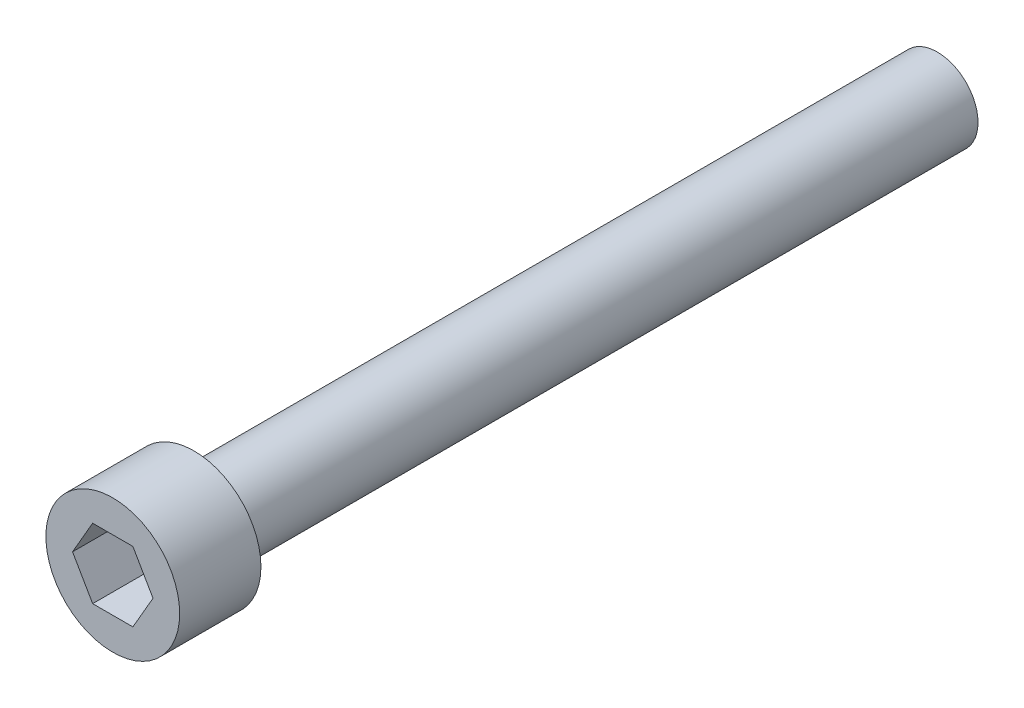
ISO-10303-21;
HEADER;
FILE_DESCRIPTION(('STEP AP214'),'2;1');
FILE_NAME('part.step','',(''),(''),'','','');
FILE_SCHEMA(('AUTOMOTIVE_DESIGN { 1 0 10303 214 1 1 1 1 }'));
ENDSEC;
DATA;
#1=APPLICATION_CONTEXT('core data for automotive mechanical design processes');
#2=APPLICATION_PROTOCOL_DEFINITION('international standard','automotive_design',2000,#1);
#3=PRODUCT_CONTEXT('',#1,'mechanical');
#4=PRODUCT('Part','Part','',(#3));
#5=PRODUCT_RELATED_PRODUCT_CATEGORY('part','',(#4));
#6=PRODUCT_DEFINITION_FORMATION('','',#4);
#7=PRODUCT_DEFINITION_CONTEXT('part definition',#1,'design');
#8=PRODUCT_DEFINITION('design','',#6,#7);
#9=PRODUCT_DEFINITION_SHAPE('','',#8);
#10=(LENGTH_UNIT() NAMED_UNIT(*) SI_UNIT(.MILLI.,.METRE.));
#11=(NAMED_UNIT(*) PLANE_ANGLE_UNIT() SI_UNIT($,.RADIAN.));
#12=(NAMED_UNIT(*) SI_UNIT($,.STERADIAN.) SOLID_ANGLE_UNIT());
#13=UNCERTAINTY_MEASURE_WITH_UNIT(LENGTH_MEASURE(1.E-05),#10,'distance_accuracy_value','');
#14=(GEOMETRIC_REPRESENTATION_CONTEXT(3) GLOBAL_UNCERTAINTY_ASSIGNED_CONTEXT((#13)) GLOBAL_UNIT_ASSIGNED_CONTEXT((#10,
#11,#12)) REPRESENTATION_CONTEXT('',''));
#15=CARTESIAN_POINT('',(0.,0.,0.));
#16=DIRECTION('',(0.,0.,1.));
#17=DIRECTION('',(1.,0.,0.));
#18=AXIS2_PLACEMENT_3D('',#15,#16,#17);
#19=CARTESIAN_POINT('',(3.42900000000001,0.,0.));
#20=DIRECTION('',(0.,0.,1.));
#21=DIRECTION('',(1.,0.,0.));
#22=AXIS2_PLACEMENT_3D('',#19,#20,#21);
#23=PLANE('',#22);
#24=DIRECTION('',(0.5,0.866025403784439,0.));
#25=VECTOR('',#24,1.);
#26=CARTESIAN_POINT('',(1.03111149638085,-1.7859375,0.));
#27=LINE('',#26,#25);
#28=CARTESIAN_POINT('',(1.03111149638085,-1.7859375,0.));
#29=VERTEX_POINT('',#28);
#30=CARTESIAN_POINT('',(2.06222299276169,0.,0.));
#31=VERTEX_POINT('',#30);
#32=EDGE_CURVE('E47',#29,#31,#27,.T.);
#33=ORIENTED_EDGE('',*,*,#32,.F.);
#34=DIRECTION('',(1.,0.,0.));
#35=VECTOR('',#34,1.);
#36=CARTESIAN_POINT('',(-1.03111149638085,-1.7859375,0.));
#37=LINE('',#36,#35);
#38=CARTESIAN_POINT('',(-1.03111149638085,-1.7859375,0.));
#39=VERTEX_POINT('',#38);
#40=EDGE_CURVE('E130',#39,#29,#37,.T.);
#41=ORIENTED_EDGE('',*,*,#40,.F.);
#42=DIRECTION('',(0.5,-0.866025403784439,0.));
#43=VECTOR('',#42,1.);
#44=CARTESIAN_POINT('',(-2.06222299276169,0.,0.));
#45=LINE('',#44,#43);
#46=CARTESIAN_POINT('',(-2.06222299276169,0.,0.));
#47=VERTEX_POINT('',#46);
#48=EDGE_CURVE('E128',#47,#39,#45,.T.);
#49=ORIENTED_EDGE('',*,*,#48,.F.);
#50=DIRECTION('',(-0.5,-0.866025403784439,0.));
#51=VECTOR('',#50,1.);
#52=CARTESIAN_POINT('',(-1.03111149638085,1.7859375,0.));
#53=LINE('',#52,#51);
#54=CARTESIAN_POINT('',(-1.03111149638085,1.7859375,0.));
#55=VERTEX_POINT('',#54);
#56=EDGE_CURVE('E95',#55,#47,#53,.T.);
#57=ORIENTED_EDGE('',*,*,#56,.F.);
#58=DIRECTION('',(-1.,0.,0.));
#59=VECTOR('',#58,1.);
#60=CARTESIAN_POINT('',(1.03111149638085,1.7859375,0.));
#61=LINE('',#60,#59);
#62=CARTESIAN_POINT('',(1.03111149638085,1.7859375,0.));
#63=VERTEX_POINT('',#62);
#64=EDGE_CURVE('E124',#63,#55,#61,.T.);
#65=ORIENTED_EDGE('',*,*,#64,.F.);
#66=DIRECTION('',(-0.5,0.866025403784438,0.));
#67=VECTOR('',#66,1.);
#68=CARTESIAN_POINT('',(2.06222299276169,0.,0.));
#69=LINE('',#68,#67);
#70=EDGE_CURVE('E121',#31,#63,#69,.T.);
#71=ORIENTED_EDGE('',*,*,#70,.F.);
#72=EDGE_LOOP('',(#33,#41,#49,#57,#65,#71));
#73=FACE_BOUND('',#72,.T.);
#74=CARTESIAN_POINT('',(0.,0.,0.));
#75=DIRECTION('',(0.,0.,1.));
#76=DIRECTION('',(1.,0.,0.));
#77=AXIS2_PLACEMENT_3D('',#74,#75,#76);
#78=CIRCLE('',#77,3.42900000000001);
#79=CARTESIAN_POINT('',(3.42900000000001,0.,0.));
#80=VERTEX_POINT('',#79);
#81=EDGE_CURVE('E134',#80,#80,#78,.T.);
#82=ORIENTED_EDGE('',*,*,#81,.T.);
#83=EDGE_LOOP('',(#82));
#84=FACE_BOUND('',#83,.T.);
#85=ADVANCED_FACE('F33',(#73,#84),#23,.T.);
#86=CARTESIAN_POINT('',(0.,0.,-42.2656));
#87=DIRECTION('',(0.,0.,-1.));
#88=DIRECTION('',(-1.,0.,0.));
#89=AXIS2_PLACEMENT_3D('',#86,#87,#88);
#90=PLANE('',#89);
#91=CARTESIAN_POINT('',(0.,0.,-42.2656));
#92=DIRECTION('',(0.,0.,1.));
#93=DIRECTION('',(1.,0.,0.));
#94=AXIS2_PLACEMENT_3D('',#91,#92,#93);
#95=CIRCLE('',#94,2.0828);
#96=CARTESIAN_POINT('',(2.08280000000001,0.,-42.2656));
#97=VERTEX_POINT('',#96);
#98=EDGE_CURVE('E11',#97,#97,#95,.T.);
#99=ORIENTED_EDGE('',*,*,#98,.F.);
#100=EDGE_LOOP('',(#99));
#101=FACE_BOUND('',#100,.T.);
#102=ADVANCED_FACE('F152',(#101),#90,.T.);
#103=CARTESIAN_POINT('',(0.,0.,0.));
#104=DIRECTION('',(0.,0.,1.));
#105=DIRECTION('',(1.,0.,0.));
#106=AXIS2_PLACEMENT_3D('',#103,#104,#105);
#107=CYLINDRICAL_SURFACE('',#106,2.08280000000001);
#108=ORIENTED_EDGE('',*,*,#98,.T.);
#109=EDGE_LOOP('',(#108));
#110=FACE_BOUND('',#109,.T.);
#111=CARTESIAN_POINT('',(0.,0.,-4.1656));
#112=DIRECTION('',(0.,0.,1.));
#113=DIRECTION('',(1.,0.,0.));
#114=AXIS2_PLACEMENT_3D('',#111,#112,#113);
#115=CIRCLE('',#114,2.08280000000001);
#116=CARTESIAN_POINT('',(2.08280000000001,0.,-4.1656));
#117=VERTEX_POINT('',#116);
#118=EDGE_CURVE('E40',#117,#117,#115,.T.);
#119=ORIENTED_EDGE('',*,*,#118,.F.);
#120=EDGE_LOOP('',(#119));
#121=FACE_BOUND('',#120,.T.);
#122=ADVANCED_FACE('F150',(#110,#121),#107,.T.);
#123=CARTESIAN_POINT('',(2.08280000000001,0.,-4.1656));
#124=DIRECTION('',(0.,0.,-1.));
#125=DIRECTION('',(-1.,0.,0.));
#126=AXIS2_PLACEMENT_3D('',#123,#124,#125);
#127=PLANE('',#126);
#128=ORIENTED_EDGE('',*,*,#118,.T.);
#129=EDGE_LOOP('',(#128));
#130=FACE_BOUND('',#129,.T.);
#131=CARTESIAN_POINT('',(0.,0.,-4.1656));
#132=DIRECTION('',(0.,0.,1.));
#133=DIRECTION('',(1.,0.,0.));
#134=AXIS2_PLACEMENT_3D('',#131,#132,#133);
#135=CIRCLE('',#134,3.429);
#136=CARTESIAN_POINT('',(3.429,0.,-4.1656));
#137=VERTEX_POINT('',#136);
#138=EDGE_CURVE('E142',#137,#137,#135,.T.);
#139=ORIENTED_EDGE('',*,*,#138,.F.);
#140=EDGE_LOOP('',(#139));
#141=FACE_BOUND('',#140,.T.);
#142=ADVANCED_FACE('F147',(#130,#141),#127,.T.);
#143=CARTESIAN_POINT('',(0.,0.,0.));
#144=DIRECTION('',(0.,0.,1.));
#145=DIRECTION('',(1.,0.,0.));
#146=AXIS2_PLACEMENT_3D('',#143,#144,#145);
#147=CYLINDRICAL_SURFACE('',#146,3.429);
#148=ORIENTED_EDGE('',*,*,#138,.T.);
#149=EDGE_LOOP('',(#148));
#150=FACE_BOUND('',#149,.T.);
#151=ORIENTED_EDGE('',*,*,#81,.F.);
#152=EDGE_LOOP('',(#151));
#153=FACE_BOUND('',#152,.T.);
#154=ADVANCED_FACE('F159',(#150,#153),#147,.T.);
#155=CARTESIAN_POINT('',(1.03111149638085,-1.7859375,-3.175));
#156=DIRECTION('',(0.866025403784439,-0.5,0.));
#157=DIRECTION('',(0.5,0.866025403784439,0.));
#158=AXIS2_PLACEMENT_3D('',#155,#156,#157);
#159=PLANE('',#158);
#160=ORIENTED_EDGE('',*,*,#32,.T.);
#161=DIRECTION('',(0.,0.,1.));
#162=VECTOR('',#161,1.);
#163=CARTESIAN_POINT('',(2.06222299276169,0.,-3.175));
#164=LINE('',#163,#162);
#165=CARTESIAN_POINT('',(2.06222299276169,0.,-3.175));
#166=VERTEX_POINT('',#165);
#167=EDGE_CURVE('E77',#166,#31,#164,.T.);
#168=ORIENTED_EDGE('',*,*,#167,.F.);
#169=DIRECTION('',(0.5,0.866025403784439,0.));
#170=VECTOR('',#169,1.);
#171=CARTESIAN_POINT('',(1.03111149638085,-1.7859375,-3.175));
#172=LINE('',#171,#170);
#173=CARTESIAN_POINT('',(1.03111149638085,-1.7859375,-3.175));
#174=VERTEX_POINT('',#173);
#175=EDGE_CURVE('E132',#174,#166,#172,.T.);
#176=ORIENTED_EDGE('',*,*,#175,.F.);
#177=DIRECTION('',(0.,0.,1.));
#178=VECTOR('',#177,1.);
#179=CARTESIAN_POINT('',(1.03111149638085,-1.7859375,-3.175));
#180=LINE('',#179,#178);
#181=EDGE_CURVE('E55',#174,#29,#180,.T.);
#182=ORIENTED_EDGE('',*,*,#181,.T.);
#183=EDGE_LOOP('',(#160,#168,#176,#182));
#184=FACE_BOUND('',#183,.T.);
#185=ADVANCED_FACE('F172',(#184),#159,.F.);
#186=CARTESIAN_POINT('',(-1.03111149638085,-1.7859375,-3.175));
#187=DIRECTION('',(0.,-1.,0.));
#188=DIRECTION('',(1.,0.,0.));
#189=AXIS2_PLACEMENT_3D('',#186,#187,#188);
#190=PLANE('',#189);
#191=ORIENTED_EDGE('',*,*,#40,.T.);
#192=ORIENTED_EDGE('',*,*,#181,.F.);
#193=DIRECTION('',(1.,0.,0.));
#194=VECTOR('',#193,1.);
#195=CARTESIAN_POINT('',(-1.03111149638085,-1.7859375,-3.175));
#196=LINE('',#195,#194);
#197=CARTESIAN_POINT('',(-1.03111149638085,-1.7859375,-3.175));
#198=VERTEX_POINT('',#197);
#199=EDGE_CURVE('E107',#198,#174,#196,.T.);
#200=ORIENTED_EDGE('',*,*,#199,.F.);
#201=DIRECTION('',(0.,0.,1.));
#202=VECTOR('',#201,1.);
#203=CARTESIAN_POINT('',(-1.03111149638085,-1.7859375,-3.175));
#204=LINE('',#203,#202);
#205=EDGE_CURVE('E99',#198,#39,#204,.T.);
#206=ORIENTED_EDGE('',*,*,#205,.T.);
#207=EDGE_LOOP('',(#191,#192,#200,#206));
#208=FACE_BOUND('',#207,.T.);
#209=ADVANCED_FACE('F178',(#208),#190,.F.);
#210=CARTESIAN_POINT('',(-2.06222299276169,0.,-3.175));
#211=DIRECTION('',(-0.866025403784439,-0.5,0.));
#212=DIRECTION('',(0.5,-0.866025403784439,0.));
#213=AXIS2_PLACEMENT_3D('',#210,#211,#212);
#214=PLANE('',#213);
#215=ORIENTED_EDGE('',*,*,#48,.T.);
#216=ORIENTED_EDGE('',*,*,#205,.F.);
#217=DIRECTION('',(0.5,-0.866025403784439,0.));
#218=VECTOR('',#217,1.);
#219=CARTESIAN_POINT('',(-2.06222299276169,0.,-3.175));
#220=LINE('',#219,#218);
#221=CARTESIAN_POINT('',(-2.06222299276169,0.,-3.175));
#222=VERTEX_POINT('',#221);
#223=EDGE_CURVE('E103',#222,#198,#220,.T.);
#224=ORIENTED_EDGE('',*,*,#223,.F.);
#225=DIRECTION('',(0.,0.,1.));
#226=VECTOR('',#225,1.);
#227=CARTESIAN_POINT('',(-2.06222299276169,0.,-3.175));
#228=LINE('',#227,#226);
#229=EDGE_CURVE('E88',#222,#47,#228,.T.);
#230=ORIENTED_EDGE('',*,*,#229,.T.);
#231=EDGE_LOOP('',(#215,#216,#224,#230));
#232=FACE_BOUND('',#231,.T.);
#233=ADVANCED_FACE('F104',(#232),#214,.F.);
#234=CARTESIAN_POINT('',(-1.03111149638085,1.7859375,-3.175));
#235=DIRECTION('',(-0.866025403784439,0.5,0.));
#236=DIRECTION('',(-0.5,-0.866025403784439,0.));
#237=AXIS2_PLACEMENT_3D('',#234,#235,#236);
#238=PLANE('',#237);
#239=ORIENTED_EDGE('',*,*,#56,.T.);
#240=ORIENTED_EDGE('',*,*,#229,.F.);
#241=DIRECTION('',(-0.5,-0.866025403784439,0.));
#242=VECTOR('',#241,1.);
#243=CARTESIAN_POINT('',(-1.03111149638085,1.7859375,-3.175));
#244=LINE('',#243,#242);
#245=CARTESIAN_POINT('',(-1.03111149638085,1.7859375,-3.175));
#246=VERTEX_POINT('',#245);
#247=EDGE_CURVE('E92',#246,#222,#244,.T.);
#248=ORIENTED_EDGE('',*,*,#247,.F.);
#249=DIRECTION('',(0.,0.,1.));
#250=VECTOR('',#249,1.);
#251=CARTESIAN_POINT('',(-1.03111149638085,1.7859375,-3.175));
#252=LINE('',#251,#250);
#253=EDGE_CURVE('E100',#246,#55,#252,.T.);
#254=ORIENTED_EDGE('',*,*,#253,.T.);
#255=EDGE_LOOP('',(#239,#240,#248,#254));
#256=FACE_BOUND('',#255,.T.);
#257=ADVANCED_FACE('F90',(#256),#238,.F.);
#258=CARTESIAN_POINT('',(1.03111149638085,1.7859375,-3.175));
#259=DIRECTION('',(0.,1.,0.));
#260=DIRECTION('',(0.,0.,1.));
#261=AXIS2_PLACEMENT_3D('',#258,#259,#260);
#262=PLANE('',#261);
#263=ORIENTED_EDGE('',*,*,#64,.T.);
#264=ORIENTED_EDGE('',*,*,#253,.F.);
#265=DIRECTION('',(-1.,0.,0.));
#266=VECTOR('',#265,1.);
#267=CARTESIAN_POINT('',(1.03111149638085,1.7859375,-3.175));
#268=LINE('',#267,#266);
#269=CARTESIAN_POINT('',(1.03111149638085,1.7859375,-3.175));
#270=VERTEX_POINT('',#269);
#271=EDGE_CURVE('E113',#270,#246,#268,.T.);
#272=ORIENTED_EDGE('',*,*,#271,.F.);
#273=DIRECTION('',(0.,0.,1.));
#274=VECTOR('',#273,1.);
#275=CARTESIAN_POINT('',(1.03111149638085,1.7859375,-3.175));
#276=LINE('',#275,#274);
#277=EDGE_CURVE('E137',#270,#63,#276,.T.);
#278=ORIENTED_EDGE('',*,*,#277,.T.);
#279=EDGE_LOOP('',(#263,#264,#272,#278));
#280=FACE_BOUND('',#279,.T.);
#281=ADVANCED_FACE('F184',(#280),#262,.F.);
#282=CARTESIAN_POINT('',(2.06222299276169,0.,-3.175));
#283=DIRECTION('',(0.866025403784438,0.5,0.));
#284=DIRECTION('',(-0.5,0.866025403784439,0.));
#285=AXIS2_PLACEMENT_3D('',#282,#283,#284);
#286=PLANE('',#285);
#287=ORIENTED_EDGE('',*,*,#70,.T.);
#288=ORIENTED_EDGE('',*,*,#277,.F.);
#289=DIRECTION('',(-0.5,0.866025403784438,0.));
#290=VECTOR('',#289,1.);
#291=CARTESIAN_POINT('',(2.06222299276169,0.,-3.175));
#292=LINE('',#291,#290);
#293=EDGE_CURVE('E115',#166,#270,#292,.T.);
#294=ORIENTED_EDGE('',*,*,#293,.F.);
#295=ORIENTED_EDGE('',*,*,#167,.T.);
#296=EDGE_LOOP('',(#287,#288,#294,#295));
#297=FACE_BOUND('',#296,.T.);
#298=ADVANCED_FACE('F181',(#297),#286,.F.);
#299=CARTESIAN_POINT('',(0.,0.,-3.175));
#300=DIRECTION('',(0.,0.,1.));
#301=DIRECTION('',(1.,0.,0.));
#302=AXIS2_PLACEMENT_3D('',#299,#300,#301);
#303=PLANE('',#302);
#304=ORIENTED_EDGE('',*,*,#175,.T.);
#305=ORIENTED_EDGE('',*,*,#293,.T.);
#306=ORIENTED_EDGE('',*,*,#271,.T.);
#307=ORIENTED_EDGE('',*,*,#247,.T.);
#308=ORIENTED_EDGE('',*,*,#223,.T.);
#309=ORIENTED_EDGE('',*,*,#199,.T.);
#310=EDGE_LOOP('',(#304,#305,#306,#307,#308,#309));
#311=FACE_BOUND('',#310,.T.);
#312=ADVANCED_FACE('F110',(#311),#303,.T.);
#313=CLOSED_SHELL('',(#85,#102,#122,#142,#154,#185,#209,#233,#257,#281,#298,#312));
#314=MANIFOLD_SOLID_BREP('B2',#313);
#315=ADVANCED_BREP_SHAPE_REPRESENTATION('',(#18,#314),#14);
#316=SHAPE_DEFINITION_REPRESENTATION(#9,#315);
ENDSEC;
END-ISO-10303-21;
